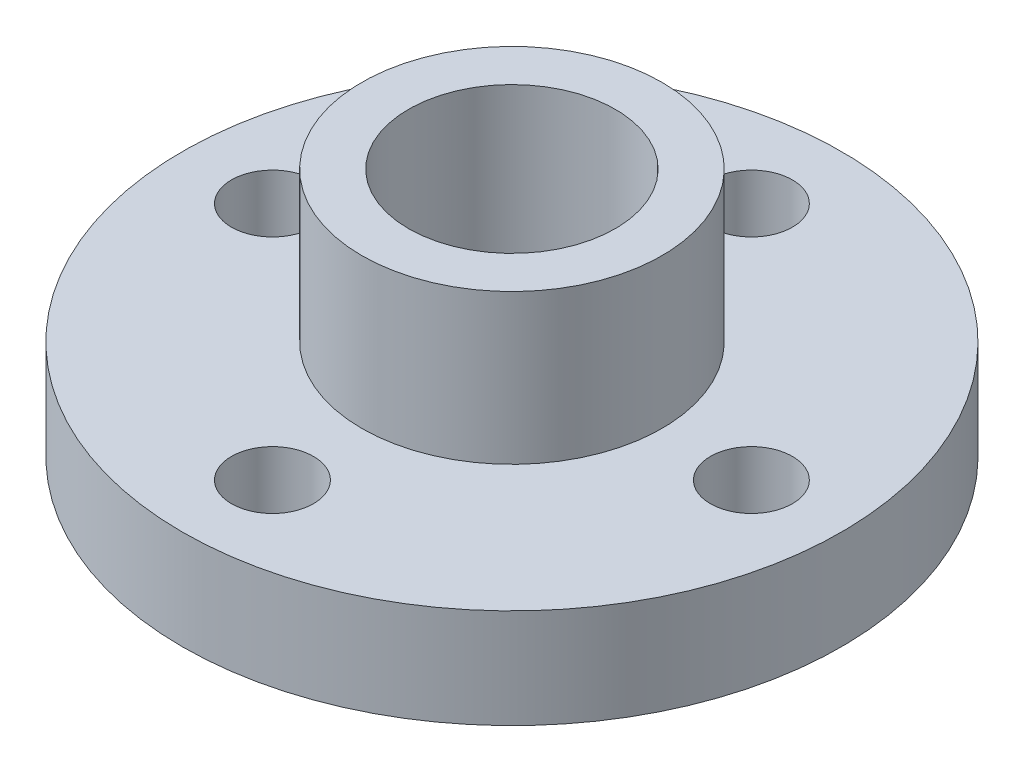
ISO-10303-21;
HEADER;
FILE_DESCRIPTION(('STEP AP214'),'2;1');
FILE_NAME('part.step','',(''),(''),'','','');
FILE_SCHEMA(('AUTOMOTIVE_DESIGN { 1 0 10303 214 1 1 1 1 }'));
ENDSEC;
DATA;
#1=APPLICATION_CONTEXT('core data for automotive mechanical design processes');
#2=APPLICATION_PROTOCOL_DEFINITION('international standard','automotive_design',2000,#1);
#3=PRODUCT_CONTEXT('',#1,'mechanical');
#4=PRODUCT('Part','Part','',(#3));
#5=PRODUCT_RELATED_PRODUCT_CATEGORY('part','',(#4));
#6=PRODUCT_DEFINITION_FORMATION('','',#4);
#7=PRODUCT_DEFINITION_CONTEXT('part definition',#1,'design');
#8=PRODUCT_DEFINITION('design','',#6,#7);
#9=PRODUCT_DEFINITION_SHAPE('','',#8);
#10=(LENGTH_UNIT() NAMED_UNIT(*) SI_UNIT(.MILLI.,.METRE.));
#11=(NAMED_UNIT(*) PLANE_ANGLE_UNIT() SI_UNIT($,.RADIAN.));
#12=(NAMED_UNIT(*) SI_UNIT($,.STERADIAN.) SOLID_ANGLE_UNIT());
#13=UNCERTAINTY_MEASURE_WITH_UNIT(LENGTH_MEASURE(1.E-05),#10,'distance_accuracy_value','');
#14=(GEOMETRIC_REPRESENTATION_CONTEXT(3) GLOBAL_UNCERTAINTY_ASSIGNED_CONTEXT((#13)) GLOBAL_UNIT_ASSIGNED_CONTEXT((#10,
#11,#12)) REPRESENTATION_CONTEXT('',''));
#15=CARTESIAN_POINT('',(0.,0.,0.));
#16=DIRECTION('',(0.,0.,1.));
#17=DIRECTION('',(1.,0.,0.));
#18=AXIS2_PLACEMENT_3D('',#15,#16,#17);
#19=CARTESIAN_POINT('',(0.,3.32,0.));
#20=DIRECTION('',(0.,-1.,0.));
#21=DIRECTION('',(0.,0.,-1.));
#22=AXIS2_PLACEMENT_3D('',#19,#20,#21);
#23=CYLINDRICAL_SURFACE('',#22,11.01);
#24=CARTESIAN_POINT('',(0.,3.32,0.));
#25=DIRECTION('',(0.,1.,0.));
#26=DIRECTION('',(0.,0.,1.));
#27=AXIS2_PLACEMENT_3D('',#24,#25,#26);
#28=CIRCLE('',#27,11.01);
#29=CARTESIAN_POINT('',(0.,3.32,11.01));
#30=VERTEX_POINT('',#29);
#31=EDGE_CURVE('E36',#30,#30,#28,.T.);
#32=ORIENTED_EDGE('',*,*,#31,.F.);
#33=EDGE_LOOP('',(#32));
#34=FACE_BOUND('',#33,.T.);
#35=CARTESIAN_POINT('',(0.,0.,0.));
#36=DIRECTION('',(0.,1.,0.));
#37=DIRECTION('',(0.,0.,1.));
#38=AXIS2_PLACEMENT_3D('',#35,#36,#37);
#39=CIRCLE('',#38,11.01);
#40=CARTESIAN_POINT('',(0.,0.,11.01));
#41=VERTEX_POINT('',#40);
#42=EDGE_CURVE('E40',#41,#41,#39,.T.);
#43=ORIENTED_EDGE('',*,*,#42,.T.);
#44=EDGE_LOOP('',(#43));
#45=FACE_BOUND('',#44,.T.);
#46=ADVANCED_FACE('F30',(#34,#45),#23,.T.);
#47=CARTESIAN_POINT('',(0.,3.32,0.));
#48=DIRECTION('',(0.,1.,0.));
#49=DIRECTION('',(0.,0.,1.));
#50=AXIS2_PLACEMENT_3D('',#47,#48,#49);
#51=PLANE('',#50);
#52=CARTESIAN_POINT('',(0.,3.32,0.));
#53=DIRECTION('',(0.,1.,0.));
#54=DIRECTION('',(0.,0.,1.));
#55=AXIS2_PLACEMENT_3D('',#52,#53,#54);
#56=CIRCLE('',#55,5.015);
#57=CARTESIAN_POINT('',(0.,3.32,5.015));
#58=VERTEX_POINT('',#57);
#59=EDGE_CURVE('E71',#58,#58,#56,.T.);
#60=ORIENTED_EDGE('',*,*,#59,.F.);
#61=EDGE_LOOP('',(#60));
#62=FACE_BOUND('',#61,.T.);
#63=CARTESIAN_POINT('',(-8.,3.32,0.));
#64=DIRECTION('',(0.,1.,0.));
#65=DIRECTION('',(0.,0.,1.));
#66=AXIS2_PLACEMENT_3D('',#63,#64,#65);
#67=CIRCLE('',#66,1.37);
#68=CARTESIAN_POINT('',(-8.,3.32,1.37));
#69=VERTEX_POINT('',#68);
#70=EDGE_CURVE('E45',#69,#69,#67,.T.);
#71=ORIENTED_EDGE('',*,*,#70,.F.);
#72=EDGE_LOOP('',(#71));
#73=FACE_BOUND('',#72,.T.);
#74=CARTESIAN_POINT('',(0.,3.32,-8.));
#75=DIRECTION('',(0.,1.,0.));
#76=DIRECTION('',(0.,0.,1.));
#77=AXIS2_PLACEMENT_3D('',#74,#75,#76);
#78=CIRCLE('',#77,1.37);
#79=CARTESIAN_POINT('',(0.,3.32,-6.63));
#80=VERTEX_POINT('',#79);
#81=EDGE_CURVE('E49',#80,#80,#78,.T.);
#82=ORIENTED_EDGE('',*,*,#81,.F.);
#83=EDGE_LOOP('',(#82));
#84=FACE_BOUND('',#83,.T.);
#85=CARTESIAN_POINT('',(8.,3.32,0.));
#86=DIRECTION('',(0.,1.,0.));
#87=DIRECTION('',(0.,0.,1.));
#88=AXIS2_PLACEMENT_3D('',#85,#86,#87);
#89=CIRCLE('',#88,1.37);
#90=CARTESIAN_POINT('',(8.,3.32,1.37));
#91=VERTEX_POINT('',#90);
#92=EDGE_CURVE('E52',#91,#91,#89,.T.);
#93=ORIENTED_EDGE('',*,*,#92,.F.);
#94=EDGE_LOOP('',(#93));
#95=FACE_BOUND('',#94,.T.);
#96=CARTESIAN_POINT('',(0.,3.32,8.));
#97=DIRECTION('',(0.,1.,0.));
#98=DIRECTION('',(0.,0.,1.));
#99=AXIS2_PLACEMENT_3D('',#96,#97,#98);
#100=CIRCLE('',#99,1.37);
#101=CARTESIAN_POINT('',(0.,3.32,9.37));
#102=VERTEX_POINT('',#101);
#103=EDGE_CURVE('E55',#102,#102,#100,.T.);
#104=ORIENTED_EDGE('',*,*,#103,.F.);
#105=EDGE_LOOP('',(#104));
#106=FACE_BOUND('',#105,.T.);
#107=ORIENTED_EDGE('',*,*,#31,.T.);
#108=EDGE_LOOP('',(#107));
#109=FACE_BOUND('',#108,.T.);
#110=ADVANCED_FACE('F109',(#62,#73,#84,#95,#106,#109),#51,.T.);
#111=CARTESIAN_POINT('',(0.,0.,0.));
#112=DIRECTION('',(0.,1.,0.));
#113=DIRECTION('',(0.,0.,1.));
#114=AXIS2_PLACEMENT_3D('',#111,#112,#113);
#115=PLANE('',#114);
#116=CARTESIAN_POINT('',(0.,0.,0.));
#117=DIRECTION('',(0.,1.,0.));
#118=DIRECTION('',(0.,0.,1.));
#119=AXIS2_PLACEMENT_3D('',#116,#117,#118);
#120=CIRCLE('',#119,5.015);
#121=CARTESIAN_POINT('',(0.,0.,5.015));
#122=VERTEX_POINT('',#121);
#123=EDGE_CURVE('E10',#122,#122,#120,.F.);
#124=ORIENTED_EDGE('',*,*,#123,.F.);
#125=EDGE_LOOP('',(#124));
#126=FACE_BOUND('',#125,.T.);
#127=CARTESIAN_POINT('',(-8.,0.,0.));
#128=DIRECTION('',(0.,1.,0.));
#129=DIRECTION('',(0.,0.,1.));
#130=AXIS2_PLACEMENT_3D('',#127,#128,#129);
#131=CIRCLE('',#130,1.37);
#132=CARTESIAN_POINT('',(-8.,0.,1.37));
#133=VERTEX_POINT('',#132);
#134=EDGE_CURVE('E58',#133,#133,#131,.T.);
#135=ORIENTED_EDGE('',*,*,#134,.T.);
#136=EDGE_LOOP('',(#135));
#137=FACE_BOUND('',#136,.T.);
#138=CARTESIAN_POINT('',(0.,0.,-8.));
#139=DIRECTION('',(0.,1.,0.));
#140=DIRECTION('',(0.,0.,1.));
#141=AXIS2_PLACEMENT_3D('',#138,#139,#140);
#142=CIRCLE('',#141,1.37);
#143=CARTESIAN_POINT('',(0.,0.,-6.63));
#144=VERTEX_POINT('',#143);
#145=EDGE_CURVE('E66',#144,#144,#142,.T.);
#146=ORIENTED_EDGE('',*,*,#145,.T.);
#147=EDGE_LOOP('',(#146));
#148=FACE_BOUND('',#147,.T.);
#149=CARTESIAN_POINT('',(8.,0.,0.));
#150=DIRECTION('',(0.,1.,0.));
#151=DIRECTION('',(0.,0.,1.));
#152=AXIS2_PLACEMENT_3D('',#149,#150,#151);
#153=CIRCLE('',#152,1.37);
#154=CARTESIAN_POINT('',(8.,0.,1.37));
#155=VERTEX_POINT('',#154);
#156=EDGE_CURVE('E62',#155,#155,#153,.T.);
#157=ORIENTED_EDGE('',*,*,#156,.T.);
#158=EDGE_LOOP('',(#157));
#159=FACE_BOUND('',#158,.T.);
#160=CARTESIAN_POINT('',(0.,0.,8.));
#161=DIRECTION('',(0.,1.,0.));
#162=DIRECTION('',(0.,0.,1.));
#163=AXIS2_PLACEMENT_3D('',#160,#161,#162);
#164=CIRCLE('',#163,1.37);
#165=CARTESIAN_POINT('',(0.,0.,9.37));
#166=VERTEX_POINT('',#165);
#167=EDGE_CURVE('E59',#166,#166,#164,.T.);
#168=ORIENTED_EDGE('',*,*,#167,.T.);
#169=EDGE_LOOP('',(#168));
#170=FACE_BOUND('',#169,.T.);
#171=ORIENTED_EDGE('',*,*,#42,.F.);
#172=EDGE_LOOP('',(#171));
#173=FACE_BOUND('',#172,.T.);
#174=ADVANCED_FACE('F112',(#126,#137,#148,#159,#170,#173),#115,.F.);
#175=CARTESIAN_POINT('',(0.,0.,8.));
#176=DIRECTION('',(0.,1.,0.));
#177=DIRECTION('',(0.,0.,1.));
#178=AXIS2_PLACEMENT_3D('',#175,#176,#177);
#179=CYLINDRICAL_SURFACE('',#178,1.37);
#180=ORIENTED_EDGE('',*,*,#103,.T.);
#181=EDGE_LOOP('',(#180));
#182=FACE_BOUND('',#181,.T.);
#183=ORIENTED_EDGE('',*,*,#167,.F.);
#184=EDGE_LOOP('',(#183));
#185=FACE_BOUND('',#184,.T.);
#186=ADVANCED_FACE('F122',(#182,#185),#179,.F.);
#187=CARTESIAN_POINT('',(8.,0.,0.));
#188=DIRECTION('',(0.,1.,0.));
#189=DIRECTION('',(0.,0.,1.));
#190=AXIS2_PLACEMENT_3D('',#187,#188,#189);
#191=CYLINDRICAL_SURFACE('',#190,1.37);
#192=ORIENTED_EDGE('',*,*,#92,.T.);
#193=EDGE_LOOP('',(#192));
#194=FACE_BOUND('',#193,.T.);
#195=ORIENTED_EDGE('',*,*,#156,.F.);
#196=EDGE_LOOP('',(#195));
#197=FACE_BOUND('',#196,.T.);
#198=ADVANCED_FACE('F125',(#194,#197),#191,.F.);
#199=CARTESIAN_POINT('',(0.,0.,-8.));
#200=DIRECTION('',(0.,1.,0.));
#201=DIRECTION('',(0.,0.,1.));
#202=AXIS2_PLACEMENT_3D('',#199,#200,#201);
#203=CYLINDRICAL_SURFACE('',#202,1.37);
#204=ORIENTED_EDGE('',*,*,#81,.T.);
#205=EDGE_LOOP('',(#204));
#206=FACE_BOUND('',#205,.T.);
#207=ORIENTED_EDGE('',*,*,#145,.F.);
#208=EDGE_LOOP('',(#207));
#209=FACE_BOUND('',#208,.T.);
#210=ADVANCED_FACE('F159',(#206,#209),#203,.F.);
#211=CARTESIAN_POINT('',(-8.,0.,0.));
#212=DIRECTION('',(0.,1.,0.));
#213=DIRECTION('',(0.,0.,1.));
#214=AXIS2_PLACEMENT_3D('',#211,#212,#213);
#215=CYLINDRICAL_SURFACE('',#214,1.37);
#216=ORIENTED_EDGE('',*,*,#70,.T.);
#217=EDGE_LOOP('',(#216));
#218=FACE_BOUND('',#217,.T.);
#219=ORIENTED_EDGE('',*,*,#134,.F.);
#220=EDGE_LOOP('',(#219));
#221=FACE_BOUND('',#220,.T.);
#222=ADVANCED_FACE('F105',(#218,#221),#215,.F.);
#223=CARTESIAN_POINT('',(0.,8.32,0.));
#224=DIRECTION('',(0.,-1.,0.));
#225=DIRECTION('',(0.,0.,-1.));
#226=AXIS2_PLACEMENT_3D('',#223,#224,#225);
#227=CYLINDRICAL_SURFACE('',#226,5.015);
#228=CARTESIAN_POINT('',(0.,8.32,0.));
#229=DIRECTION('',(0.,1.,0.));
#230=DIRECTION('',(0.,0.,1.));
#231=AXIS2_PLACEMENT_3D('',#228,#229,#230);
#232=CIRCLE('',#231,5.015);
#233=CARTESIAN_POINT('',(0.,8.32,5.015));
#234=VERTEX_POINT('',#233);
#235=EDGE_CURVE('E63',#234,#234,#232,.T.);
#236=ORIENTED_EDGE('',*,*,#235,.F.);
#237=EDGE_LOOP('',(#236));
#238=FACE_BOUND('',#237,.T.);
#239=ORIENTED_EDGE('',*,*,#59,.T.);
#240=EDGE_LOOP('',(#239));
#241=FACE_BOUND('',#240,.T.);
#242=ADVANCED_FACE('F99',(#238,#241),#227,.T.);
#243=CARTESIAN_POINT('',(0.,8.32,0.));
#244=DIRECTION('',(0.,1.,0.));
#245=DIRECTION('',(0.,0.,1.));
#246=AXIS2_PLACEMENT_3D('',#243,#244,#245);
#247=PLANE('',#246);
#248=CARTESIAN_POINT('',(0.,8.32,0.));
#249=DIRECTION('',(0.,1.,0.));
#250=DIRECTION('',(0.,0.,1.));
#251=AXIS2_PLACEMENT_3D('',#248,#249,#250);
#252=CIRCLE('',#251,3.455);
#253=CARTESIAN_POINT('',(0.,8.32,3.455));
#254=VERTEX_POINT('',#253);
#255=EDGE_CURVE('E80',#254,#254,#252,.T.);
#256=ORIENTED_EDGE('',*,*,#255,.F.);
#257=EDGE_LOOP('',(#256));
#258=FACE_BOUND('',#257,.T.);
#259=ORIENTED_EDGE('',*,*,#235,.T.);
#260=EDGE_LOOP('',(#259));
#261=FACE_BOUND('',#260,.T.);
#262=ADVANCED_FACE('F95',(#258,#261),#247,.T.);
#263=CARTESIAN_POINT('',(0.,-2.03,0.));
#264=DIRECTION('',(0.,1.,0.));
#265=DIRECTION('',(0.,0.,1.));
#266=AXIS2_PLACEMENT_3D('',#263,#264,#265);
#267=CYLINDRICAL_SURFACE('',#266,5.015);
#268=CARTESIAN_POINT('',(0.,-2.03,0.));
#269=DIRECTION('',(0.,-1.,0.));
#270=DIRECTION('',(0.,0.,-1.));
#271=AXIS2_PLACEMENT_3D('',#268,#269,#270);
#272=CIRCLE('',#271,5.015);
#273=CARTESIAN_POINT('',(0.,-2.03,-5.015));
#274=VERTEX_POINT('',#273);
#275=EDGE_CURVE('E74',#274,#274,#272,.T.);
#276=ORIENTED_EDGE('',*,*,#275,.F.);
#277=EDGE_LOOP('',(#276));
#278=FACE_BOUND('',#277,.T.);
#279=ORIENTED_EDGE('',*,*,#123,.T.);
#280=EDGE_LOOP('',(#279));
#281=FACE_BOUND('',#280,.T.);
#282=ADVANCED_FACE('F98',(#278,#281),#267,.T.);
#283=CARTESIAN_POINT('',(0.,-2.03,0.));
#284=DIRECTION('',(0.,-1.,0.));
#285=DIRECTION('',(0.,0.,-1.));
#286=AXIS2_PLACEMENT_3D('',#283,#284,#285);
#287=PLANE('',#286);
#288=CARTESIAN_POINT('',(0.,-2.03,0.));
#289=DIRECTION('',(0.,1.,0.));
#290=DIRECTION('',(0.,0.,1.));
#291=AXIS2_PLACEMENT_3D('',#288,#289,#290);
#292=CIRCLE('',#291,3.455);
#293=CARTESIAN_POINT('',(0.,-2.03,3.455));
#294=VERTEX_POINT('',#293);
#295=EDGE_CURVE('E79',#294,#294,#292,.T.);
#296=ORIENTED_EDGE('',*,*,#295,.T.);
#297=EDGE_LOOP('',(#296));
#298=FACE_BOUND('',#297,.T.);
#299=ORIENTED_EDGE('',*,*,#275,.T.);
#300=EDGE_LOOP('',(#299));
#301=FACE_BOUND('',#300,.T.);
#302=ADVANCED_FACE('F86',(#298,#301),#287,.T.);
#303=CARTESIAN_POINT('',(0.,-2.03,0.));
#304=DIRECTION('',(0.,1.,0.));
#305=DIRECTION('',(0.,0.,1.));
#306=AXIS2_PLACEMENT_3D('',#303,#304,#305);
#307=CYLINDRICAL_SURFACE('',#306,3.455);
#308=ORIENTED_EDGE('',*,*,#295,.F.);
#309=EDGE_LOOP('',(#308));
#310=FACE_BOUND('',#309,.T.);
#311=ORIENTED_EDGE('',*,*,#255,.T.);
#312=EDGE_LOOP('',(#311));
#313=FACE_BOUND('',#312,.T.);
#314=ADVANCED_FACE('F89',(#310,#313),#307,.F.);
#315=CLOSED_SHELL('',(#46,#110,#174,#186,#198,#210,#222,#242,#262,#282,#302,#314));
#316=MANIFOLD_SOLID_BREP('B2',#315);
#317=ADVANCED_BREP_SHAPE_REPRESENTATION('',(#18,#316),#14);
#318=SHAPE_DEFINITION_REPRESENTATION(#9,#317);
ENDSEC;
END-ISO-10303-21;
